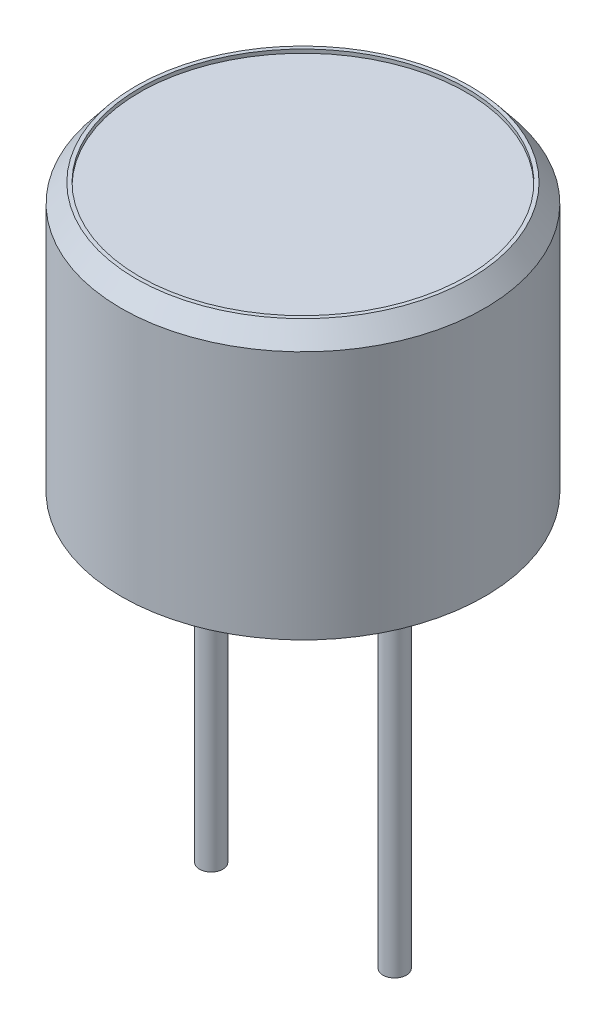
ISO-10303-21;
HEADER;
FILE_DESCRIPTION(('STEP AP214'),'2;1');
FILE_NAME('part.step','',(''),(''),'','','');
FILE_SCHEMA(('AUTOMOTIVE_DESIGN { 1 0 10303 214 1 1 1 1 }'));
ENDSEC;
DATA;
#1=APPLICATION_CONTEXT('core data for automotive mechanical design processes');
#2=APPLICATION_PROTOCOL_DEFINITION('international standard','automotive_design',2000,#1);
#3=PRODUCT_CONTEXT('',#1,'mechanical');
#4=PRODUCT('Part','Part','',(#3));
#5=PRODUCT_RELATED_PRODUCT_CATEGORY('part','',(#4));
#6=PRODUCT_DEFINITION_FORMATION('','',#4);
#7=PRODUCT_DEFINITION_CONTEXT('part definition',#1,'design');
#8=PRODUCT_DEFINITION('design','',#6,#7);
#9=PRODUCT_DEFINITION_SHAPE('','',#8);
#10=(LENGTH_UNIT() NAMED_UNIT(*) SI_UNIT(.MILLI.,.METRE.));
#11=(NAMED_UNIT(*) PLANE_ANGLE_UNIT() SI_UNIT($,.RADIAN.));
#12=(NAMED_UNIT(*) SI_UNIT($,.STERADIAN.) SOLID_ANGLE_UNIT());
#13=UNCERTAINTY_MEASURE_WITH_UNIT(LENGTH_MEASURE(1.E-05),#10,'distance_accuracy_value','');
#14=(GEOMETRIC_REPRESENTATION_CONTEXT(3) GLOBAL_UNCERTAINTY_ASSIGNED_CONTEXT((#13)) GLOBAL_UNIT_ASSIGNED_CONTEXT((#10,
#11,#12)) REPRESENTATION_CONTEXT('',''));
#15=CARTESIAN_POINT('',(0.,0.,0.));
#16=DIRECTION('',(0.,0.,1.));
#17=DIRECTION('',(1.,0.,0.));
#18=AXIS2_PLACEMENT_3D('',#15,#16,#17);
#19=CARTESIAN_POINT('',(0.,7.3,0.));
#20=DIRECTION('',(0.,-1.,0.));
#21=DIRECTION('',(0.,0.,-1.));
#22=AXIS2_PLACEMENT_3D('',#19,#20,#21);
#23=CYLINDRICAL_SURFACE('',#22,4.95);
#24=CARTESIAN_POINT('',(0.,6.8,0.));
#25=DIRECTION('',(0.,1.,0.));
#26=DIRECTION('',(0.,0.,1.));
#27=AXIS2_PLACEMENT_3D('',#24,#25,#26);
#28=CIRCLE('',#27,4.95);
#29=CARTESIAN_POINT('',(0.,6.8,4.95));
#30=VERTEX_POINT('',#29);
#31=EDGE_CURVE('E51',#30,#30,#28,.F.);
#32=ORIENTED_EDGE('',*,*,#31,.T.);
#33=EDGE_LOOP('',(#32));
#34=FACE_BOUND('',#33,.T.);
#35=CARTESIAN_POINT('',(0.,0.,0.));
#36=DIRECTION('',(0.,1.,0.));
#37=DIRECTION('',(0.,0.,1.));
#38=AXIS2_PLACEMENT_3D('',#35,#36,#37);
#39=CIRCLE('',#38,4.95);
#40=CARTESIAN_POINT('',(0.,0.,4.95));
#41=VERTEX_POINT('',#40);
#42=EDGE_CURVE('E62',#41,#41,#39,.T.);
#43=ORIENTED_EDGE('',*,*,#42,.T.);
#44=EDGE_LOOP('',(#43));
#45=FACE_BOUND('',#44,.T.);
#46=ADVANCED_FACE('F38',(#34,#45),#23,.T.);
#47=CARTESIAN_POINT('',(0.,7.3,0.));
#48=DIRECTION('',(0.,1.,0.));
#49=DIRECTION('',(0.,0.,1.));
#50=AXIS2_PLACEMENT_3D('',#47,#48,#49);
#51=PLANE('',#50);
#52=CARTESIAN_POINT('',(0.,7.3,0.));
#53=DIRECTION('',(0.,1.,0.));
#54=DIRECTION('',(0.,0.,1.));
#55=AXIS2_PLACEMENT_3D('',#52,#53,#54);
#56=CIRCLE('',#55,4.45);
#57=CARTESIAN_POINT('',(0.,7.3,4.45));
#58=VERTEX_POINT('',#57);
#59=EDGE_CURVE('E75',#58,#58,#56,.T.);
#60=ORIENTED_EDGE('',*,*,#59,.F.);
#61=EDGE_LOOP('',(#60));
#62=FACE_BOUND('',#61,.T.);
#63=CARTESIAN_POINT('',(0.,7.3,0.));
#64=DIRECTION('',(0.,1.,0.));
#65=DIRECTION('',(0.,0.,1.));
#66=AXIS2_PLACEMENT_3D('',#63,#64,#65);
#67=CIRCLE('',#66,4.55);
#68=CARTESIAN_POINT('',(0.,7.3,4.55));
#69=VERTEX_POINT('',#68);
#70=EDGE_CURVE('E56',#69,#69,#67,.T.);
#71=ORIENTED_EDGE('',*,*,#70,.T.);
#72=EDGE_LOOP('',(#71));
#73=FACE_BOUND('',#72,.T.);
#74=ADVANCED_FACE('F92',(#62,#73),#51,.T.);
#75=CARTESIAN_POINT('',(0.,0.,0.));
#76=DIRECTION('',(0.,1.,0.));
#77=DIRECTION('',(0.,0.,1.));
#78=AXIS2_PLACEMENT_3D('',#75,#76,#77);
#79=PLANE('',#78);
#80=CARTESIAN_POINT('',(2.5,0.,0.));
#81=DIRECTION('',(0.,1.,0.));
#82=DIRECTION('',(0.,0.,1.));
#83=AXIS2_PLACEMENT_3D('',#80,#81,#82);
#84=CIRCLE('',#83,0.32);
#85=CARTESIAN_POINT('',(2.5,0.,0.320000000000001));
#86=VERTEX_POINT('',#85);
#87=EDGE_CURVE('E10',#86,#86,#84,.F.);
#88=ORIENTED_EDGE('',*,*,#87,.F.);
#89=EDGE_LOOP('',(#88));
#90=FACE_BOUND('',#89,.T.);
#91=CARTESIAN_POINT('',(-2.5,0.,0.));
#92=DIRECTION('',(0.,1.,0.));
#93=DIRECTION('',(0.,0.,1.));
#94=AXIS2_PLACEMENT_3D('',#91,#92,#93);
#95=CIRCLE('',#94,0.32);
#96=CARTESIAN_POINT('',(-2.5,0.,0.32));
#97=VERTEX_POINT('',#96);
#98=EDGE_CURVE('E46',#97,#97,#95,.F.);
#99=ORIENTED_EDGE('',*,*,#98,.F.);
#100=EDGE_LOOP('',(#99));
#101=FACE_BOUND('',#100,.T.);
#102=ORIENTED_EDGE('',*,*,#42,.F.);
#103=EDGE_LOOP('',(#102));
#104=FACE_BOUND('',#103,.T.);
#105=ADVANCED_FACE('F95',(#90,#101,#104),#79,.F.);
#106=CARTESIAN_POINT('',(0.,7.3,0.));
#107=DIRECTION('',(0.,-1.,0.));
#108=DIRECTION('',(0.,0.,-1.));
#109=AXIS2_PLACEMENT_3D('',#106,#107,#108);
#110=CONICAL_SURFACE('',#109,4.55,0.674740942223554);
#111=ORIENTED_EDGE('',*,*,#31,.F.);
#112=EDGE_LOOP('',(#111));
#113=FACE_BOUND('',#112,.T.);
#114=ORIENTED_EDGE('',*,*,#70,.F.);
#115=EDGE_LOOP('',(#114));
#116=FACE_BOUND('',#115,.T.);
#117=ADVANCED_FACE('F40',(#113,#116),#110,.T.);
#118=CARTESIAN_POINT('',(-2.5,-10.,0.));
#119=DIRECTION('',(0.,1.,0.));
#120=DIRECTION('',(0.,0.,1.));
#121=AXIS2_PLACEMENT_3D('',#118,#119,#120);
#122=CYLINDRICAL_SURFACE('',#121,0.32);
#123=CARTESIAN_POINT('',(-2.5,-10.,0.));
#124=DIRECTION('',(0.,-1.,0.));
#125=DIRECTION('',(0.,0.,-1.));
#126=AXIS2_PLACEMENT_3D('',#123,#124,#125);
#127=CIRCLE('',#126,0.32);
#128=CARTESIAN_POINT('',(-2.5,-10.,-0.32));
#129=VERTEX_POINT('',#128);
#130=EDGE_CURVE('E66',#129,#129,#127,.T.);
#131=ORIENTED_EDGE('',*,*,#130,.F.);
#132=EDGE_LOOP('',(#131));
#133=FACE_BOUND('',#132,.T.);
#134=ORIENTED_EDGE('',*,*,#98,.T.);
#135=EDGE_LOOP('',(#134));
#136=FACE_BOUND('',#135,.T.);
#137=ADVANCED_FACE('F100',(#133,#136),#122,.T.);
#138=CARTESIAN_POINT('',(-2.5,-10.,0.));
#139=DIRECTION('',(0.,-1.,0.));
#140=DIRECTION('',(0.,0.,-1.));
#141=AXIS2_PLACEMENT_3D('',#138,#139,#140);
#142=PLANE('',#141);
#143=ORIENTED_EDGE('',*,*,#130,.T.);
#144=EDGE_LOOP('',(#143));
#145=FACE_BOUND('',#144,.T.);
#146=ADVANCED_FACE('F106',(#145),#142,.T.);
#147=CARTESIAN_POINT('',(2.5,-10.,0.));
#148=DIRECTION('',(0.,1.,0.));
#149=DIRECTION('',(0.,0.,1.));
#150=AXIS2_PLACEMENT_3D('',#147,#148,#149);
#151=CYLINDRICAL_SURFACE('',#150,0.32);
#152=CARTESIAN_POINT('',(2.5,-10.,0.));
#153=DIRECTION('',(0.,-1.,0.));
#154=DIRECTION('',(0.,0.,-1.));
#155=AXIS2_PLACEMENT_3D('',#152,#153,#154);
#156=CIRCLE('',#155,0.32);
#157=CARTESIAN_POINT('',(2.5,-10.,-0.319999999999999));
#158=VERTEX_POINT('',#157);
#159=EDGE_CURVE('E70',#158,#158,#156,.T.);
#160=ORIENTED_EDGE('',*,*,#159,.F.);
#161=EDGE_LOOP('',(#160));
#162=FACE_BOUND('',#161,.T.);
#163=ORIENTED_EDGE('',*,*,#87,.T.);
#164=EDGE_LOOP('',(#163));
#165=FACE_BOUND('',#164,.T.);
#166=ADVANCED_FACE('F121',(#162,#165),#151,.T.);
#167=CARTESIAN_POINT('',(2.5,-10.,0.));
#168=DIRECTION('',(0.,-1.,0.));
#169=DIRECTION('',(0.,0.,-1.));
#170=AXIS2_PLACEMENT_3D('',#167,#168,#169);
#171=PLANE('',#170);
#172=ORIENTED_EDGE('',*,*,#159,.T.);
#173=EDGE_LOOP('',(#172));
#174=FACE_BOUND('',#173,.T.);
#175=ADVANCED_FACE('F88',(#174),#171,.T.);
#176=CARTESIAN_POINT('',(0.,7.2,0.));
#177=DIRECTION('',(0.,1.,0.));
#178=DIRECTION('',(0.,0.,1.));
#179=AXIS2_PLACEMENT_3D('',#176,#177,#178);
#180=CYLINDRICAL_SURFACE('',#179,4.45);
#181=CARTESIAN_POINT('',(0.,7.2,0.));
#182=DIRECTION('',(0.,1.,0.));
#183=DIRECTION('',(0.,0.,1.));
#184=AXIS2_PLACEMENT_3D('',#181,#182,#183);
#185=CIRCLE('',#184,4.45);
#186=CARTESIAN_POINT('',(0.,7.2,4.45));
#187=VERTEX_POINT('',#186);
#188=EDGE_CURVE('E74',#187,#187,#185,.T.);
#189=ORIENTED_EDGE('',*,*,#188,.F.);
#190=EDGE_LOOP('',(#189));
#191=FACE_BOUND('',#190,.T.);
#192=ORIENTED_EDGE('',*,*,#59,.T.);
#193=EDGE_LOOP('',(#192));
#194=FACE_BOUND('',#193,.T.);
#195=ADVANCED_FACE('F85',(#191,#194),#180,.F.);
#196=CARTESIAN_POINT('',(0.,7.2,0.));
#197=DIRECTION('',(0.,1.,0.));
#198=DIRECTION('',(0.,0.,1.));
#199=AXIS2_PLACEMENT_3D('',#196,#197,#198);
#200=PLANE('',#199);
#201=ORIENTED_EDGE('',*,*,#188,.T.);
#202=EDGE_LOOP('',(#201));
#203=FACE_BOUND('',#202,.T.);
#204=ADVANCED_FACE('F83',(#203),#200,.T.);
#205=CLOSED_SHELL('',(#46,#74,#105,#117,#137,#146,#166,#175,#195,#204));
#206=MANIFOLD_SOLID_BREP('B2',#205);
#207=ADVANCED_BREP_SHAPE_REPRESENTATION('',(#18,#206),#14);
#208=SHAPE_DEFINITION_REPRESENTATION(#9,#207);
ENDSEC;
END-ISO-10303-21;
